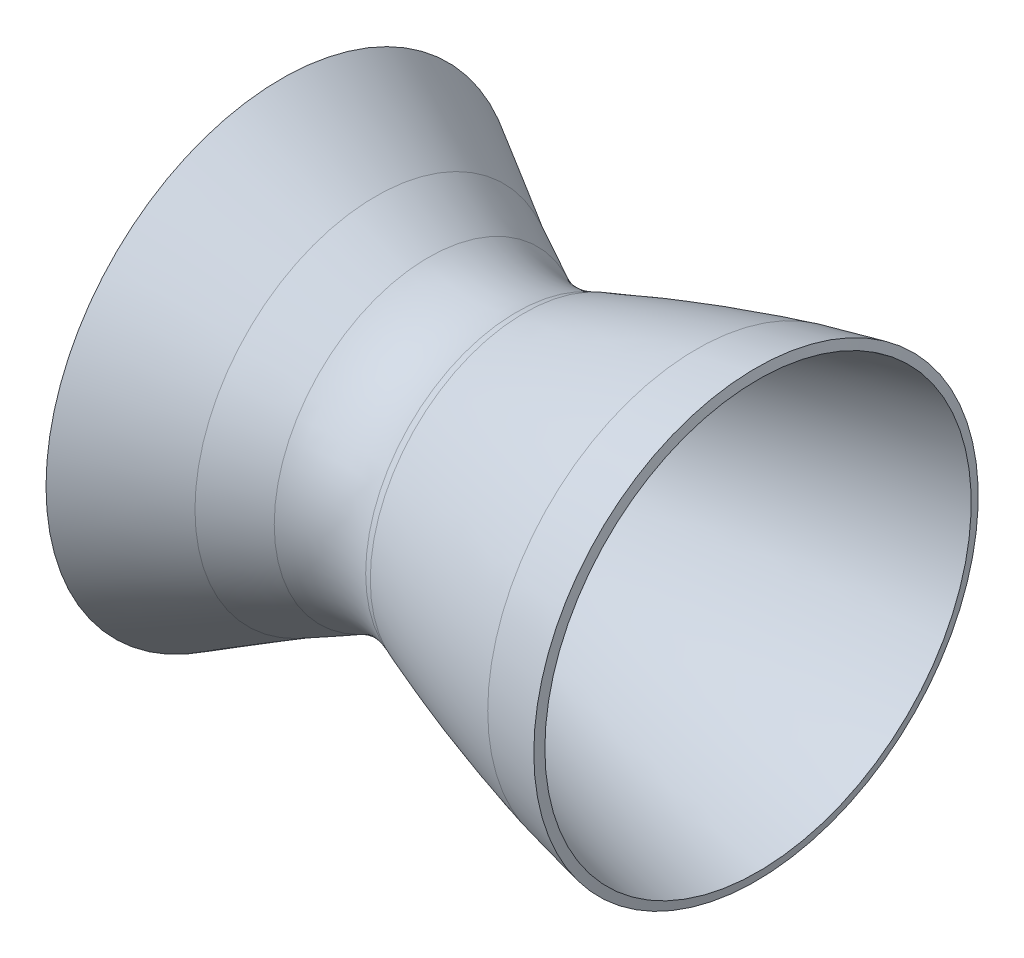
ISO-10303-21;
HEADER;
FILE_DESCRIPTION(('STEP AP214'),'2;1');
FILE_NAME('part.step','',(''),(''),'','','');
FILE_SCHEMA(('AUTOMOTIVE_DESIGN { 1 0 10303 214 1 1 1 1 }'));
ENDSEC;
DATA;
#1=APPLICATION_CONTEXT('core data for automotive mechanical design processes');
#2=APPLICATION_PROTOCOL_DEFINITION('international standard','automotive_design',2000,#1);
#3=PRODUCT_CONTEXT('',#1,'mechanical');
#4=PRODUCT('Part','Part','',(#3));
#5=PRODUCT_RELATED_PRODUCT_CATEGORY('part','',(#4));
#6=PRODUCT_DEFINITION_FORMATION('','',#4);
#7=PRODUCT_DEFINITION_CONTEXT('part definition',#1,'design');
#8=PRODUCT_DEFINITION('design','',#6,#7);
#9=PRODUCT_DEFINITION_SHAPE('','',#8);
#10=(LENGTH_UNIT() NAMED_UNIT(*) SI_UNIT(.MILLI.,.METRE.));
#11=(NAMED_UNIT(*) PLANE_ANGLE_UNIT() SI_UNIT($,.RADIAN.));
#12=(NAMED_UNIT(*) SI_UNIT($,.STERADIAN.) SOLID_ANGLE_UNIT());
#13=UNCERTAINTY_MEASURE_WITH_UNIT(LENGTH_MEASURE(1.E-05),#10,'distance_accuracy_value','');
#14=(GEOMETRIC_REPRESENTATION_CONTEXT(3) GLOBAL_UNCERTAINTY_ASSIGNED_CONTEXT((#13)) GLOBAL_UNIT_ASSIGNED_CONTEXT((#10,
#11,#12)) REPRESENTATION_CONTEXT('',''));
#15=CARTESIAN_POINT('',(0.,0.,0.));
#16=DIRECTION('',(0.,0.,1.));
#17=DIRECTION('',(1.,0.,0.));
#18=AXIS2_PLACEMENT_3D('',#15,#16,#17);
#19=CARTESIAN_POINT('',(-94.4373045516378,-48.8611668095888,0.));
#20=DIRECTION('',(-1.,0.,0.));
#21=DIRECTION('',(0.,0.,1.));
#22=AXIS2_PLACEMENT_3D('',#19,#20,#21);
#23=TOROIDAL_SURFACE('',#22,61.523572333694,26.162);
#24=CARTESIAN_POINT('',(-106.25203471594,-48.8611668095888,0.));
#25=DIRECTION('',(-1.,0.,0.));
#26=DIRECTION('',(0.,0.,1.));
#27=AXIS2_PLACEMENT_3D('',#24,#25,#26);
#28=CIRCLE('',#27,38.1812846320842);
#29=CARTESIAN_POINT('',(-106.25203471594,-48.8611668095888,38.1812846320842));
#30=VERTEX_POINT('',#29);
#31=EDGE_CURVE('E79',#30,#30,#28,.T.);
#32=ORIENTED_EDGE('',*,*,#31,.F.);
#33=EDGE_LOOP('',(#32));
#34=FACE_BOUND('',#33,.T.);
#35=CARTESIAN_POINT('',(-84.4667201869889,-48.8611668095888,0.));
#36=DIRECTION('',(-1.,0.,0.));
#37=DIRECTION('',(0.,0.,1.));
#38=AXIS2_PLACEMENT_3D('',#35,#36,#37);
#39=CIRCLE('',#38,37.3360199269824);
#40=CARTESIAN_POINT('',(-84.4667201869889,-48.8611668095888,37.3360199269824));
#41=VERTEX_POINT('',#40);
#42=EDGE_CURVE('E10',#41,#41,#39,.T.);
#43=ORIENTED_EDGE('',*,*,#42,.T.);
#44=EDGE_LOOP('',(#43));
#45=FACE_BOUND('',#44,.T.);
#46=ADVANCED_FACE('F35',(#34,#45),#23,.F.);
#47=CARTESIAN_POINT('',(-82.5264901048797,-48.8611668095888,0.));
#48=DIRECTION('',(1.,0.,0.));
#49=DIRECTION('',(0.,0.,-1.));
#50=AXIS2_PLACEMENT_3D('',#47,#48,#49);
#51=CONICAL_SURFACE('',#50,38.1358208905198,0.390995971257055);
#52=ORIENTED_EDGE('',*,*,#42,.F.);
#53=EDGE_LOOP('',(#52));
#54=FACE_BOUND('',#53,.T.);
#55=CARTESIAN_POINT('',(-82.5264901048797,-48.8611668095888,0.));
#56=DIRECTION('',(-1.,0.,0.));
#57=DIRECTION('',(0.,0.,1.));
#58=AXIS2_PLACEMENT_3D('',#55,#56,#57);
#59=CIRCLE('',#58,38.1358208905198);
#60=CARTESIAN_POINT('',(-82.5264901048797,-48.8611668095888,38.1358208905198));
#61=VERTEX_POINT('',#60);
#62=EDGE_CURVE('E42',#61,#61,#59,.T.);
#63=ORIENTED_EDGE('',*,*,#62,.T.);
#64=EDGE_LOOP('',(#63));
#65=FACE_BOUND('',#64,.T.);
#66=ADVANCED_FACE('F97',(#54,#65),#51,.T.);
#67=CARTESIAN_POINT('',(-39.8865731326242,2.84328061309022,0.));
#68=CARTESIAN_POINT('',(-47.0946892707503,0.963982134191625,0.));
#69=CARTESIAN_POINT('',(-61.3920473865361,-3.17140273665201,0.));
#70=CARTESIAN_POINT('',(-75.5357718764957,-8.08782657545548,0.));
#71=CARTESIAN_POINT('',(-82.5264901048797,-10.725345919069,0.));
#72=B_SPLINE_CURVE_WITH_KNOTS('',3,(#67,#68,#69,#70,#71),.UNSPECIFIED.,.F.,.F.,(4,1,4),
(0.214165291497943,0.507948806381841,0.80173232126574),.UNSPECIFIED.);
#73=CARTESIAN_POINT('',(-89.9347704698219,-48.8611668095888,0.));
#74=DIRECTION('',(-1.,0.,0.));
#75=AXIS1_PLACEMENT('',#73,#74);
#76=SURFACE_OF_REVOLUTION('',#72,#75);
#77=ORIENTED_EDGE('',*,*,#62,.F.);
#78=EDGE_LOOP('',(#77));
#79=FACE_BOUND('',#78,.T.);
#80=CARTESIAN_POINT('',(-39.8865731326242,-48.8611668095888,0.));
#81=DIRECTION('',(-1.,0.,0.));
#82=DIRECTION('',(0.,0.,1.));
#83=AXIS2_PLACEMENT_3D('',#80,#81,#82);
#84=CIRCLE('',#83,51.704447422679);
#85=CARTESIAN_POINT('',(-39.8865731326242,-48.8611668095888,51.704447422679));
#86=VERTEX_POINT('',#85);
#87=EDGE_CURVE('E48',#86,#86,#84,.T.);
#88=ORIENTED_EDGE('',*,*,#87,.T.);
#89=EDGE_LOOP('',(#88));
#90=FACE_BOUND('',#89,.T.);
#91=ADVANCED_FACE('F93',(#79,#90),#76,.T.);
#92=CARTESIAN_POINT('',(-25.1855335973153,-48.8611668095888,0.));
#93=DIRECTION('',(1.,0.,0.));
#94=DIRECTION('',(0.,0.,-1.));
#95=AXIS2_PLACEMENT_3D('',#92,#93,#94);
#96=CONICAL_SURFACE('',#95,55.002918137815,0.22071461964725);
#97=ORIENTED_EDGE('',*,*,#87,.F.);
#98=EDGE_LOOP('',(#97));
#99=FACE_BOUND('',#98,.T.);
#100=CARTESIAN_POINT('',(-25.1855335973153,-48.8611668095888,0.));
#101=DIRECTION('',(-1.,0.,0.));
#102=DIRECTION('',(0.,0.,1.));
#103=AXIS2_PLACEMENT_3D('',#100,#101,#102);
#104=CIRCLE('',#103,55.002918137815);
#105=CARTESIAN_POINT('',(-25.1855335973153,-48.8611668095888,55.002918137815));
#106=VERTEX_POINT('',#105);
#107=EDGE_CURVE('E52',#106,#106,#104,.T.);
#108=ORIENTED_EDGE('',*,*,#107,.T.);
#109=EDGE_LOOP('',(#108));
#110=FACE_BOUND('',#109,.T.);
#111=ADVANCED_FACE('F96',(#99,#110),#96,.T.);
#112=CARTESIAN_POINT('',(-24.6835685147827,-48.8611668095888,0.));
#113=DIRECTION('',(-1.,0.,0.));
#114=DIRECTION('',(0.,0.,1.));
#115=AXIS2_PLACEMENT_3D('',#112,#113,#114);
#116=CONICAL_SURFACE('',#115,52.765696964441,1.35008170714764);
#117=ORIENTED_EDGE('',*,*,#107,.F.);
#118=EDGE_LOOP('',(#117));
#119=FACE_BOUND('',#118,.T.);
#120=CARTESIAN_POINT('',(-24.6835685147827,-48.8611668095888,0.));
#121=DIRECTION('',(-1.,0.,0.));
#122=DIRECTION('',(0.,0.,1.));
#123=AXIS2_PLACEMENT_3D('',#120,#121,#122);
#124=CIRCLE('',#123,52.765696964441);
#125=CARTESIAN_POINT('',(-24.6835685147827,-48.8611668095888,52.765696964441));
#126=VERTEX_POINT('',#125);
#127=EDGE_CURVE('E57',#126,#126,#124,.T.);
#128=ORIENTED_EDGE('',*,*,#127,.T.);
#129=EDGE_LOOP('',(#128));
#130=FACE_BOUND('',#129,.T.);
#131=ADVANCED_FACE('F140',(#119,#130),#116,.T.);
#132=CARTESIAN_POINT('',(-95.5530910997631,-18.6351668095888,0.));
#133=CARTESIAN_POINT('',(-89.8004835764461,-16.2321006993171,0.));
#134=CARTESIAN_POINT('',(-78.169339757772,-11.6675006114371,0.));
#135=CARTESIAN_POINT('',(-54.6915036512911,-3.62570294894569,0.));
#136=CARTESIAN_POINT('',(-36.7621957895667,1.21380770315525,0.));
#137=CARTESIAN_POINT('',(-24.6835685147827,3.90453015485225,0.));
#138=B_SPLINE_CURVE_WITH_KNOTS('',3,(#132,#133,#134,#135,#136,#137),.UNSPECIFIED.,.F.,.F.,(4,1,
1,4),(0.0175086981395631,0.263131523604672,0.508754349069782,1.),.UNSPECIFIED.);
#139=CARTESIAN_POINT('',(-89.9347704698219,-48.8611668095888,0.));
#140=DIRECTION('',(-1.,0.,0.));
#141=AXIS1_PLACEMENT('',#139,#140);
#142=SURFACE_OF_REVOLUTION('',#138,#141);
#143=ORIENTED_EDGE('',*,*,#127,.F.);
#144=EDGE_LOOP('',(#143));
#145=FACE_BOUND('',#144,.T.);
#146=CARTESIAN_POINT('',(-95.5530910997631,-48.8611668095888,0.));
#147=DIRECTION('',(-1.,0.,0.));
#148=DIRECTION('',(0.,0.,1.));
#149=AXIS2_PLACEMENT_3D('',#146,#147,#148);
#150=CIRCLE('',#149,30.226);
#151=CARTESIAN_POINT('',(-95.5530910997631,-48.8611668095888,30.226));
#152=VERTEX_POINT('',#151);
#153=EDGE_CURVE('E60',#152,#152,#150,.T.);
#154=ORIENTED_EDGE('',*,*,#153,.T.);
#155=EDGE_LOOP('',(#154));
#156=FACE_BOUND('',#155,.T.);
#157=ADVANCED_FACE('F137',(#145,#156),#142,.T.);
#158=CARTESIAN_POINT('',(-94.45893531829,-48.8611668095888,0.));
#159=DIRECTION('',(-1.,0.,0.));
#160=DIRECTION('',(0.,0.,1.));
#161=AXIS2_PLACEMENT_3D('',#158,#159,#160);
#162=TOROIDAL_SURFACE('',#161,43.6434612772264,13.462);
#163=ORIENTED_EDGE('',*,*,#153,.F.);
#164=EDGE_LOOP('',(#163));
#165=FACE_BOUND('',#164,.T.);
#166=CARTESIAN_POINT('',(-101.189934492491,-48.8611668095888,0.));
#167=DIRECTION('',(-1.,0.,0.));
#168=DIRECTION('',(0.,0.,1.));
#169=AXIS2_PLACEMENT_3D('',#166,#167,#168);
#170=CIRCLE('',#169,31.9850268147048);
#171=CARTESIAN_POINT('',(-101.189934492491,-48.8611668095888,31.9850268147048));
#172=VERTEX_POINT('',#171);
#173=EDGE_CURVE('E63',#172,#172,#170,.T.);
#174=ORIENTED_EDGE('',*,*,#173,.T.);
#175=EDGE_LOOP('',(#174));
#176=FACE_BOUND('',#175,.T.);
#177=ADVANCED_FACE('F133',(#165,#176),#162,.T.);
#178=CARTESIAN_POINT('',(-120.282432541347,-48.8611668095888,0.));
#179=DIRECTION('',(-1.,0.,0.));
#180=DIRECTION('',(0.,0.,1.));
#181=AXIS2_PLACEMENT_3D('',#178,#179,#180);
#182=CONICAL_SURFACE('',#181,43.0080838995483,0.523598704765514);
#183=ORIENTED_EDGE('',*,*,#173,.F.);
#184=EDGE_LOOP('',(#183));
#185=FACE_BOUND('',#184,.T.);
#186=CARTESIAN_POINT('',(-120.282432541347,-48.8611668095888,0.));
#187=DIRECTION('',(-1.,0.,0.));
#188=DIRECTION('',(0.,0.,1.));
#189=AXIS2_PLACEMENT_3D('',#186,#187,#188);
#190=CIRCLE('',#189,43.0080838995483);
#191=CARTESIAN_POINT('',(-120.282432541347,-48.8611668095888,43.0080838995483));
#192=VERTEX_POINT('',#191);
#193=EDGE_CURVE('E67',#192,#192,#190,.T.);
#194=ORIENTED_EDGE('',*,*,#193,.T.);
#195=EDGE_LOOP('',(#194));
#196=FACE_BOUND('',#195,.T.);
#197=ADVANCED_FACE('F129',(#185,#196),#182,.F.);
#198=CARTESIAN_POINT('',(-142.651647032258,-48.8611668095888,0.));
#199=DIRECTION('',(-1.,0.,0.));
#200=DIRECTION('',(0.,0.,1.));
#201=AXIS2_PLACEMENT_3D('',#198,#199,#200);
#202=CONICAL_SURFACE('',#201,55.7351312772263,0.517278453908498);
#203=ORIENTED_EDGE('',*,*,#193,.F.);
#204=EDGE_LOOP('',(#203));
#205=FACE_BOUND('',#204,.T.);
#206=CARTESIAN_POINT('',(-142.651647032258,-48.8611668095888,0.));
#207=DIRECTION('',(-1.,0.,0.));
#208=DIRECTION('',(0.,0.,1.));
#209=AXIS2_PLACEMENT_3D('',#206,#207,#208);
#210=CIRCLE('',#209,55.7351312772263);
#211=CARTESIAN_POINT('',(-142.651647032258,-48.8611668095888,55.7351312772263));
#212=VERTEX_POINT('',#211);
#213=EDGE_CURVE('E70',#212,#212,#210,.T.);
#214=ORIENTED_EDGE('',*,*,#213,.T.);
#215=EDGE_LOOP('',(#214));
#216=FACE_BOUND('',#215,.T.);
#217=ADVANCED_FACE('F125',(#205,#216),#202,.F.);
#218=CARTESIAN_POINT('',(-142.651647032258,6.87396446763756,0.));
#219=DIRECTION('',(1.,0.,0.));
#220=DIRECTION('',(0.,0.,-1.));
#221=AXIS2_PLACEMENT_3D('',#218,#219,#220);
#222=PLANE('',#221);
#223=ORIENTED_EDGE('',*,*,#213,.F.);
#224=EDGE_LOOP('',(#223));
#225=FACE_BOUND('',#224,.T.);
#226=CARTESIAN_POINT('',(-142.651647032258,-48.8611668095888,0.));
#227=DIRECTION('',(-1.,0.,0.));
#228=DIRECTION('',(0.,0.,1.));
#229=AXIS2_PLACEMENT_3D('',#226,#227,#228);
#230=CIRCLE('',#229,58.2692021384538);
#231=CARTESIAN_POINT('',(-142.651647032258,-48.8611668095888,58.2692021384538));
#232=VERTEX_POINT('',#231);
#233=EDGE_CURVE('E73',#232,#232,#230,.T.);
#234=ORIENTED_EDGE('',*,*,#233,.T.);
#235=EDGE_LOOP('',(#234));
#236=FACE_BOUND('',#235,.T.);
#237=ADVANCED_FACE('F118',(#225,#236),#222,.F.);
#238=CARTESIAN_POINT('',(-119.277599097427,-48.8611668095888,0.));
#239=DIRECTION('',(-1.,0.,0.));
#240=DIRECTION('',(0.,0.,1.));
#241=AXIS2_PLACEMENT_3D('',#238,#239,#240);
#242=CONICAL_SURFACE('',#241,44.7741914787597,0.523598704765514);
#243=ORIENTED_EDGE('',*,*,#233,.F.);
#244=EDGE_LOOP('',(#243));
#245=FACE_BOUND('',#244,.T.);
#246=CARTESIAN_POINT('',(-119.277599097427,-48.8611668095888,0.));
#247=DIRECTION('',(-1.,0.,0.));
#248=DIRECTION('',(0.,0.,1.));
#249=AXIS2_PLACEMENT_3D('',#246,#247,#248);
#250=CIRCLE('',#249,44.7741914787597);
#251=CARTESIAN_POINT('',(-119.277599097427,-48.8611668095888,44.7741914787597));
#252=VERTEX_POINT('',#251);
#253=EDGE_CURVE('E76',#252,#252,#250,.T.);
#254=ORIENTED_EDGE('',*,*,#253,.T.);
#255=EDGE_LOOP('',(#254));
#256=FACE_BOUND('',#255,.T.);
#257=ADVANCED_FACE('F112',(#245,#256),#242,.T.);
#258=CARTESIAN_POINT('',(-106.25203471594,-48.8611668095888,0.));
#259=DIRECTION('',(-1.,0.,0.));
#260=DIRECTION('',(0.,0.,1.));
#261=AXIS2_PLACEMENT_3D('',#258,#259,#260);
#262=CONICAL_SURFACE('',#261,38.1812846320842,0.468556561636407);
#263=ORIENTED_EDGE('',*,*,#253,.F.);
#264=EDGE_LOOP('',(#263));
#265=FACE_BOUND('',#264,.T.);
#266=ORIENTED_EDGE('',*,*,#31,.T.);
#267=EDGE_LOOP('',(#266));
#268=FACE_BOUND('',#267,.T.);
#269=ADVANCED_FACE('F110',(#265,#268),#262,.T.);
#270=CLOSED_SHELL('',(#46,#66,#91,#111,#131,#157,#177,#197,#217,#237,#257,#269));
#271=MANIFOLD_SOLID_BREP('B2',#270);
#272=ADVANCED_BREP_SHAPE_REPRESENTATION('',(#18,#271),#14);
#273=SHAPE_DEFINITION_REPRESENTATION(#9,#272);
ENDSEC;
END-ISO-10303-21;
